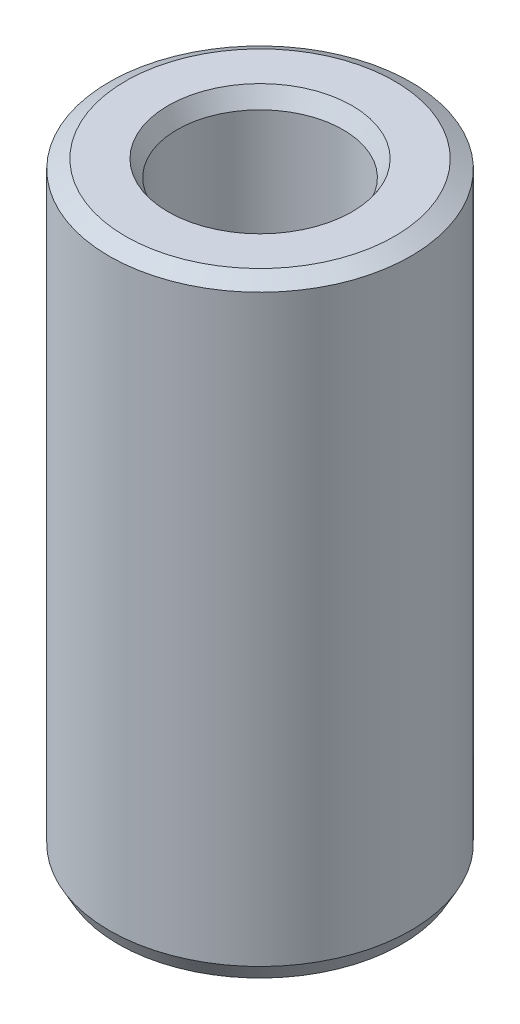
ISO-10303-21;
HEADER;
FILE_DESCRIPTION(('STEP AP214'),'2;1');
FILE_NAME('part.step','',(''),(''),'','','');
FILE_SCHEMA(('AUTOMOTIVE_DESIGN { 1 0 10303 214 1 1 1 1 }'));
ENDSEC;
DATA;
#1=APPLICATION_CONTEXT('core data for automotive mechanical design processes');
#2=APPLICATION_PROTOCOL_DEFINITION('international standard','automotive_design',2000,#1);
#3=PRODUCT_CONTEXT('',#1,'mechanical');
#4=PRODUCT('Part','Part','',(#3));
#5=PRODUCT_RELATED_PRODUCT_CATEGORY('part','',(#4));
#6=PRODUCT_DEFINITION_FORMATION('','',#4);
#7=PRODUCT_DEFINITION_CONTEXT('part definition',#1,'design');
#8=PRODUCT_DEFINITION('design','',#6,#7);
#9=PRODUCT_DEFINITION_SHAPE('','',#8);
#10=(LENGTH_UNIT() NAMED_UNIT(*) SI_UNIT(.MILLI.,.METRE.));
#11=(NAMED_UNIT(*) PLANE_ANGLE_UNIT() SI_UNIT($,.RADIAN.));
#12=(NAMED_UNIT(*) SI_UNIT($,.STERADIAN.) SOLID_ANGLE_UNIT());
#13=UNCERTAINTY_MEASURE_WITH_UNIT(LENGTH_MEASURE(1.E-05),#10,'distance_accuracy_value','');
#14=(GEOMETRIC_REPRESENTATION_CONTEXT(3) GLOBAL_UNCERTAINTY_ASSIGNED_CONTEXT((#13)) GLOBAL_UNIT_ASSIGNED_CONTEXT((#10,
#11,#12)) REPRESENTATION_CONTEXT('',''));
#15=CARTESIAN_POINT('',(0.,0.,0.));
#16=DIRECTION('',(0.,0.,1.));
#17=DIRECTION('',(1.,0.,0.));
#18=AXIS2_PLACEMENT_3D('',#15,#16,#17);
#19=CARTESIAN_POINT('',(0.,141.361519134317,0.));
#20=DIRECTION('',(0.,-1.,0.));
#21=DIRECTION('',(0.,0.,-1.));
#22=AXIS2_PLACEMENT_3D('',#19,#20,#21);
#23=CYLINDRICAL_SURFACE('',#22,35.);
#24=CARTESIAN_POINT('',(0.,3.79405472669653,0.));
#25=DIRECTION('',(0.,1.,0.));
#26=DIRECTION('',(0.,0.,1.));
#27=AXIS2_PLACEMENT_3D('',#24,#25,#26);
#28=CIRCLE('',#27,35.);
#29=CARTESIAN_POINT('',(0.,3.79405472669653,35.));
#30=VERTEX_POINT('',#29);
#31=EDGE_CURVE('E10',#30,#30,#28,.T.);
#32=ORIENTED_EDGE('',*,*,#31,.T.);
#33=EDGE_LOOP('',(#32));
#34=FACE_BOUND('',#33,.T.);
#35=CARTESIAN_POINT('',(0.,139.271582842124,0.));
#36=DIRECTION('',(0.,1.,0.));
#37=DIRECTION('',(0.,0.,1.));
#38=AXIS2_PLACEMENT_3D('',#35,#36,#37);
#39=CIRCLE('',#38,35.);
#40=CARTESIAN_POINT('',(0.,139.271582842124,35.));
#41=VERTEX_POINT('',#40);
#42=EDGE_CURVE('E50',#41,#41,#39,.F.);
#43=ORIENTED_EDGE('',*,*,#42,.T.);
#44=EDGE_LOOP('',(#43));
#45=FACE_BOUND('',#44,.T.);
#46=ADVANCED_FACE('F39',(#34,#45),#23,.T.);
#47=CARTESIAN_POINT('',(0.,141.361519134317,0.));
#48=DIRECTION('',(0.,1.,0.));
#49=DIRECTION('',(0.,0.,1.));
#50=AXIS2_PLACEMENT_3D('',#47,#48,#49);
#51=PLANE('',#50);
#52=CARTESIAN_POINT('',(0.,141.361519134317,0.));
#53=DIRECTION('',(0.,1.,0.));
#54=DIRECTION('',(0.,0.,1.));
#55=AXIS2_PLACEMENT_3D('',#52,#53,#54);
#56=CIRCLE('',#55,21.3493493543903);
#57=CARTESIAN_POINT('',(0.,141.361519134317,21.3493493543903));
#58=VERTEX_POINT('',#57);
#59=EDGE_CURVE('E58',#58,#58,#56,.F.);
#60=ORIENTED_EDGE('',*,*,#59,.T.);
#61=EDGE_LOOP('',(#60));
#62=FACE_BOUND('',#61,.T.);
#63=CARTESIAN_POINT('',(0.,141.361519134317,0.));
#64=DIRECTION('',(0.,1.,0.));
#65=DIRECTION('',(0.,0.,1.));
#66=AXIS2_PLACEMENT_3D('',#63,#64,#65);
#67=CIRCLE('',#66,31.2059452733034);
#68=CARTESIAN_POINT('',(0.,141.361519134317,31.2059452733034));
#69=VERTEX_POINT('',#68);
#70=EDGE_CURVE('E61',#69,#69,#67,.T.);
#71=ORIENTED_EDGE('',*,*,#70,.T.);
#72=EDGE_LOOP('',(#71));
#73=FACE_BOUND('',#72,.T.);
#74=ADVANCED_FACE('F88',(#62,#73),#51,.T.);
#75=CARTESIAN_POINT('',(0.,0.,0.));
#76=DIRECTION('',(0.,1.,0.));
#77=DIRECTION('',(0.,0.,1.));
#78=AXIS2_PLACEMENT_3D('',#75,#76,#77);
#79=PLANE('',#78);
#80=CARTESIAN_POINT('',(0.,0.,0.));
#81=DIRECTION('',(0.,1.,0.));
#82=DIRECTION('',(0.,0.,1.));
#83=AXIS2_PLACEMENT_3D('',#80,#81,#82);
#84=CIRCLE('',#83,23.0534677888947);
#85=CARTESIAN_POINT('',(0.,0.,23.0534677888947));
#86=VERTEX_POINT('',#85);
#87=EDGE_CURVE('E51',#86,#86,#84,.T.);
#88=ORIENTED_EDGE('',*,*,#87,.T.);
#89=EDGE_LOOP('',(#88));
#90=FACE_BOUND('',#89,.T.);
#91=CARTESIAN_POINT('',(0.,0.,0.));
#92=DIRECTION('',(0.,1.,0.));
#93=DIRECTION('',(0.,0.,1.));
#94=AXIS2_PLACEMENT_3D('',#91,#92,#93);
#95=CIRCLE('',#94,32.9100637078079);
#96=CARTESIAN_POINT('',(0.,0.,32.9100637078079));
#97=VERTEX_POINT('',#96);
#98=EDGE_CURVE('E54',#97,#97,#95,.F.);
#99=ORIENTED_EDGE('',*,*,#98,.T.);
#100=EDGE_LOOP('',(#99));
#101=FACE_BOUND('',#100,.T.);
#102=ADVANCED_FACE('F83',(#90,#101),#79,.F.);
#103=CARTESIAN_POINT('',(0.,141.361519134317,0.));
#104=DIRECTION('',(0.,-1.,0.));
#105=DIRECTION('',(0.,0.,-1.));
#106=AXIS2_PLACEMENT_3D('',#103,#104,#105);
#107=CYLINDRICAL_SURFACE('',#106,19.2594130621981);
#108=CARTESIAN_POINT('',(0.,137.56746440762,0.));
#109=DIRECTION('',(0.,1.,0.));
#110=DIRECTION('',(0.,0.,1.));
#111=AXIS2_PLACEMENT_3D('',#108,#109,#110);
#112=CIRCLE('',#111,19.2594130621981);
#113=CARTESIAN_POINT('',(0.,137.56746440762,19.2594130621981));
#114=VERTEX_POINT('',#113);
#115=EDGE_CURVE('E67',#114,#114,#112,.T.);
#116=ORIENTED_EDGE('',*,*,#115,.T.);
#117=EDGE_LOOP('',(#116));
#118=FACE_BOUND('',#117,.T.);
#119=CARTESIAN_POINT('',(0.,2.08993629219212,0.));
#120=DIRECTION('',(0.,1.,0.));
#121=DIRECTION('',(0.,0.,1.));
#122=AXIS2_PLACEMENT_3D('',#119,#120,#121);
#123=CIRCLE('',#122,19.2594130621981);
#124=CARTESIAN_POINT('',(0.,2.08993629219212,19.2594130621981));
#125=VERTEX_POINT('',#124);
#126=EDGE_CURVE('E69',#125,#125,#123,.F.);
#127=ORIENTED_EDGE('',*,*,#126,.T.);
#128=EDGE_LOOP('',(#127));
#129=FACE_BOUND('',#128,.T.);
#130=ADVANCED_FACE('F71',(#118,#129),#107,.F.);
#131=CARTESIAN_POINT('',(0.,137.56746440762,0.));
#132=DIRECTION('',(0.,1.,0.));
#133=DIRECTION('',(0.,0.,1.));
#134=AXIS2_PLACEMENT_3D('',#131,#132,#133);
#135=CONICAL_SURFACE('',#134,19.2594130621981,0.503491775566452);
#136=ORIENTED_EDGE('',*,*,#59,.F.);
#137=EDGE_LOOP('',(#136));
#138=FACE_BOUND('',#137,.T.);
#139=ORIENTED_EDGE('',*,*,#115,.F.);
#140=EDGE_LOOP('',(#139));
#141=FACE_BOUND('',#140,.T.);
#142=ADVANCED_FACE('F77',(#138,#141),#135,.F.);
#143=CARTESIAN_POINT('',(0.,0.,0.));
#144=DIRECTION('',(0.,-1.,0.));
#145=DIRECTION('',(0.,0.,-1.));
#146=AXIS2_PLACEMENT_3D('',#143,#144,#145);
#147=CONICAL_SURFACE('',#146,23.0534677888947,1.06730455122844);
#148=ORIENTED_EDGE('',*,*,#126,.F.);
#149=EDGE_LOOP('',(#148));
#150=FACE_BOUND('',#149,.T.);
#151=ORIENTED_EDGE('',*,*,#87,.F.);
#152=EDGE_LOOP('',(#151));
#153=FACE_BOUND('',#152,.T.);
#154=ADVANCED_FACE('F73',(#150,#153),#147,.F.);
#155=CARTESIAN_POINT('',(0.,3.79405472669653,0.));
#156=DIRECTION('',(0.,1.,0.));
#157=DIRECTION('',(0.,0.,1.));
#158=AXIS2_PLACEMENT_3D('',#155,#156,#157);
#159=CONICAL_SURFACE('',#158,35.,0.503491775566457);
#160=CARTESIAN_POINT('',(0.,0.,32.9100637078079));
#161=CARTESIAN_POINT('',(0.,0.0395214034030898,32.9318338775183));
#162=CARTESIAN_POINT('',(0.,0.0790428068061782,32.9536040472286));
#163=CARTESIAN_POINT('',(0.,0.158085613612355,32.9971443866493));
#164=CARTESIAN_POINT('',(0.,0.197607017015443,33.0189145563596));
#165=CARTESIAN_POINT('',(0.,0.276649823821621,33.0624548957803));
#166=CARTESIAN_POINT('',(0.,0.31617122722471,33.0842250654906));
#167=CARTESIAN_POINT('',(0.,0.395214034030888,33.1277654049113));
#168=CARTESIAN_POINT('',(0.,0.434735437433977,33.1495355746216));
#169=CARTESIAN_POINT('',(0.,0.513778244240155,33.1930759140423));
#170=CARTESIAN_POINT('',(0.,0.553299647643243,33.2148460837526));
#171=CARTESIAN_POINT('',(0.,0.63234245444942,33.2583864231733));
#172=CARTESIAN_POINT('',(0.,0.67186385785251,33.2801565928836));
#173=CARTESIAN_POINT('',(0.,0.750906664658688,33.3236969323043));
#174=CARTESIAN_POINT('',(0.,0.790428068061776,33.3454671020146));
#175=CARTESIAN_POINT('',(0.,0.869470874867953,33.3890074414353));
#176=CARTESIAN_POINT('',(0.,0.908992278271042,33.4107776111456));
#177=CARTESIAN_POINT('',(0.,0.988035085077221,33.4543179505663));
#178=CARTESIAN_POINT('',(0.,1.02755648848031,33.4760881202766));
#179=CARTESIAN_POINT('',(0.,1.10659929528649,33.5196284596973));
#180=CARTESIAN_POINT('',(0.,1.14612069868958,33.5413986294076));
#181=CARTESIAN_POINT('',(0.,1.22516350549575,33.5849389688283));
#182=CARTESIAN_POINT('',(0.,1.26468490889884,33.6067091385386));
#183=CARTESIAN_POINT('',(0.,1.34372771570502,33.6502494779593));
#184=CARTESIAN_POINT('',(0.,1.38324911910811,33.6720196476696));
#185=CARTESIAN_POINT('',(0.,1.46229192591429,33.7155599870903));
#186=CARTESIAN_POINT('',(0.,1.50181332931737,33.7373301568006));
#187=CARTESIAN_POINT('',(0.,1.58085613612355,33.7808704962213));
#188=CARTESIAN_POINT('',(0.,1.62037753952664,33.8026406659316));
#189=CARTESIAN_POINT('',(0.,1.69942034633282,33.8461810053523));
#190=CARTESIAN_POINT('',(0.,1.73894174973591,33.8679511750626));
#191=CARTESIAN_POINT('',(0.,1.81798455654209,33.9114915144833));
#192=CARTESIAN_POINT('',(0.,1.85750595994517,33.9332616841936));
#193=CARTESIAN_POINT('',(0.,1.93654876675135,33.9768020236143));
#194=CARTESIAN_POINT('',(0.,1.97607017015444,33.9985721933246));
#195=CARTESIAN_POINT('',(0.,2.05511297696062,34.0421125327453));
#196=CARTESIAN_POINT('',(0.,2.09463438036371,34.0638827024556));
#197=CARTESIAN_POINT('',(0.,2.17367718716989,34.1074230418763));
#198=CARTESIAN_POINT('',(0.,2.21319859057297,34.1291932115866));
#199=CARTESIAN_POINT('',(0.,2.29224139737915,34.1727335510073));
#200=CARTESIAN_POINT('',(0.,2.33176280078224,34.1945037207176));
#201=CARTESIAN_POINT('',(0.,2.41080560758842,34.2380440601383));
#202=CARTESIAN_POINT('',(0.,2.45032701099151,34.2598142298486));
#203=CARTESIAN_POINT('',(0.,2.52936981779768,34.3033545692693));
#204=CARTESIAN_POINT('',(0.,2.56889122120077,34.3251247389796));
#205=CARTESIAN_POINT('',(0.,2.64793402800695,34.3686650784003));
#206=CARTESIAN_POINT('',(0.,2.68745543141004,34.3904352481107));
#207=CARTESIAN_POINT('',(0.,2.76649823821622,34.4339755875313));
#208=CARTESIAN_POINT('',(0.,2.80601964161931,34.4557457572417));
#209=CARTESIAN_POINT('',(0.,2.88506244842548,34.4992860966623));
#210=CARTESIAN_POINT('',(0.,2.92458385182857,34.5210562663727));
#211=CARTESIAN_POINT('',(0.,3.00362665863475,34.5645966057933));
#212=CARTESIAN_POINT('',(0.,3.04314806203784,34.5863667755037));
#213=CARTESIAN_POINT('',(0.,3.12219086884402,34.6299071149243));
#214=CARTESIAN_POINT('',(0.,3.16171227224711,34.6516772846347));
#215=CARTESIAN_POINT('',(0.,3.24075507905328,34.6952176240553));
#216=CARTESIAN_POINT('',(0.,3.28027648245637,34.7169877937657));
#217=CARTESIAN_POINT('',(0.,3.35931928926255,34.7605281331863));
#218=CARTESIAN_POINT('',(0.,3.39884069266564,34.7822983028967));
#219=CARTESIAN_POINT('',(0.,3.47788349947182,34.8258386423173));
#220=CARTESIAN_POINT('',(0.,3.51740490287491,34.8476088120277));
#221=CARTESIAN_POINT('',(0.,3.59644770968108,34.8911491514483));
#222=CARTESIAN_POINT('',(0.,3.63596911308417,34.9129193211587));
#223=CARTESIAN_POINT('',(0.,3.71501191989035,34.9564596605793));
#224=CARTESIAN_POINT('',(0.,3.75453332329344,34.9782298302897));
#225=CARTESIAN_POINT('',(0.,3.79405472669653,35.));
#226=B_SPLINE_CURVE_WITH_KNOTS('',3,(#160,#161,#162,#163,#164,#165,#166,#167,#168,#169,#170,
#171,#172,#173,#174,#175,#176,#177,#178,#179,#180,#181,#182,#183,#184,#185,#186,#187,#188,#189,
#190,#191,#192,#193,#194,#195,#196,#197,#198,#199,#200,#201,#202,#203,#204,#205,#206,#207,#208,
#209,#210,#211,#212,#213,#214,#215,#216,#217,#218,#219,#220,#221,#222,#223,#224,#225),
.UNSPECIFIED.,.F.,.F.,(4,2,2,2,2,2,2,2,2,2,2,2,2,2,2,2,2,2,2,2,2,2,2,2,2,2,2,2,2,2,2,2,4),(0.,
0.135362234561556,0.270724469123114,0.40608670368467,0.541448938246226,0.676811172807785,
0.81217340736934,0.947535641930899,1.08289787649245,1.21826011105401,1.35362234561557,
1.48898458017712,1.62434681473868,1.75970904930024,1.8950712838618,2.03043351842335,
2.16579575298491,2.30115798754647,2.43652022210802,2.57188245666958,2.70724469123114,
2.84260692579269,2.97796916035425,3.11333139491581,3.24869362947736,3.38405586403892,
3.51941809860048,3.65478033316203,3.79014256772359,3.92550480228515,4.0608670368467,
4.19622927140826,4.33159150596982),.UNSPECIFIED.);
#227=EDGE_CURVE('BSEAM76',#97,#30,#226,.T.);
#228=ORIENTED_EDGE('',*,*,#98,.F.);
#229=ORIENTED_EDGE('',*,*,#31,.F.);
#230=ORIENTED_EDGE('',*,*,#227,.T.);
#231=ORIENTED_EDGE('',*,*,#227,.F.);
#232=EDGE_LOOP('',(#228,#230,#229,#231));
#233=FACE_BOUND('',#232,.T.);
#234=ADVANCED_FACE('F76',(#233),#159,.T.);
#235=CARTESIAN_POINT('',(0.,141.361519134317,0.));
#236=DIRECTION('',(0.,-1.,0.));
#237=DIRECTION('',(0.,0.,-1.));
#238=AXIS2_PLACEMENT_3D('',#235,#236,#237);
#239=CONICAL_SURFACE('',#238,31.2059452733034,1.06730455122844);
#240=ORIENTED_EDGE('',*,*,#42,.F.);
#241=EDGE_LOOP('',(#240));
#242=FACE_BOUND('',#241,.T.);
#243=ORIENTED_EDGE('',*,*,#70,.F.);
#244=EDGE_LOOP('',(#243));
#245=FACE_BOUND('',#244,.T.);
#246=ADVANCED_FACE('F45',(#242,#245),#239,.T.);
#247=CLOSED_SHELL('',(#46,#74,#102,#130,#142,#154,#234,#246));
#248=MANIFOLD_SOLID_BREP('B2',#247);
#249=ADVANCED_BREP_SHAPE_REPRESENTATION('',(#18,#248),#14);
#250=SHAPE_DEFINITION_REPRESENTATION(#9,#249);
ENDSEC;
END-ISO-10303-21;
